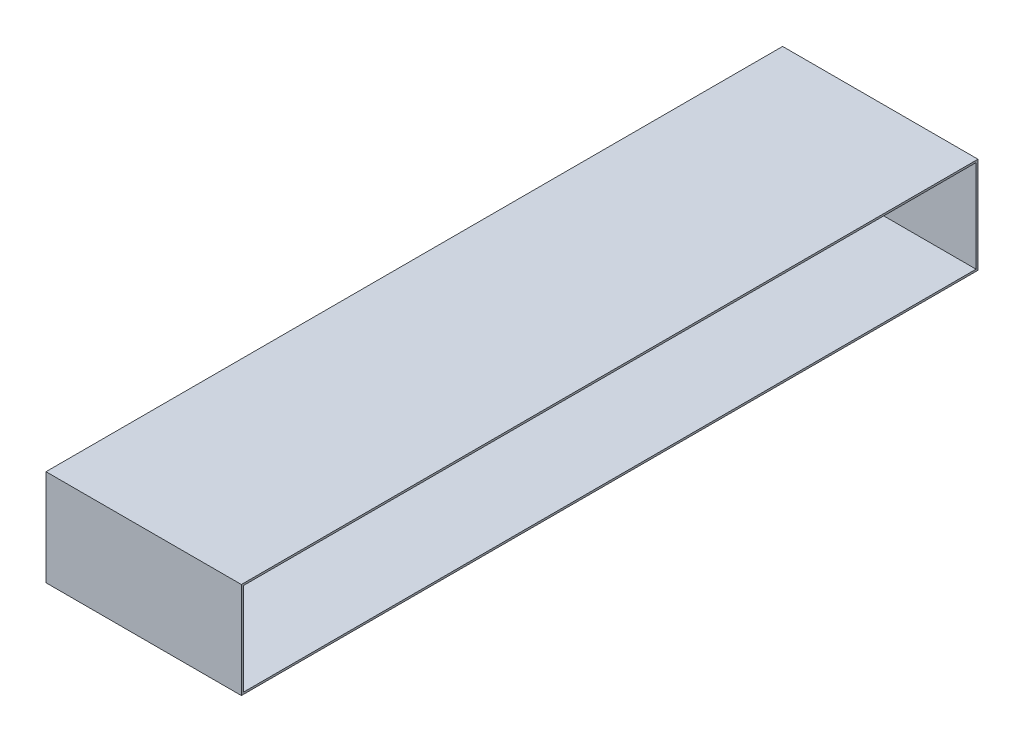
ISO-10303-21;
HEADER;
FILE_DESCRIPTION(('STEP AP214'),'2;1');
FILE_NAME('part.step','',(''),(''),'','','');
FILE_SCHEMA(('AUTOMOTIVE_DESIGN { 1 0 10303 214 1 1 1 1 }'));
ENDSEC;
DATA;
#1=APPLICATION_CONTEXT('core data for automotive mechanical design processes');
#2=APPLICATION_PROTOCOL_DEFINITION('international standard','automotive_design',2000,#1);
#3=PRODUCT_CONTEXT('',#1,'mechanical');
#4=PRODUCT('Part','Part','',(#3));
#5=PRODUCT_RELATED_PRODUCT_CATEGORY('part','',(#4));
#6=PRODUCT_DEFINITION_FORMATION('','',#4);
#7=PRODUCT_DEFINITION_CONTEXT('part definition',#1,'design');
#8=PRODUCT_DEFINITION('design','',#6,#7);
#9=PRODUCT_DEFINITION_SHAPE('','',#8);
#10=(LENGTH_UNIT() NAMED_UNIT(*) SI_UNIT(.MILLI.,.METRE.));
#11=(NAMED_UNIT(*) PLANE_ANGLE_UNIT() SI_UNIT($,.RADIAN.));
#12=(NAMED_UNIT(*) SI_UNIT($,.STERADIAN.) SOLID_ANGLE_UNIT());
#13=UNCERTAINTY_MEASURE_WITH_UNIT(LENGTH_MEASURE(1.E-05),#10,'distance_accuracy_value','');
#14=(GEOMETRIC_REPRESENTATION_CONTEXT(3) GLOBAL_UNCERTAINTY_ASSIGNED_CONTEXT((#13)) GLOBAL_UNIT_ASSIGNED_CONTEXT((#10,
#11,#12)) REPRESENTATION_CONTEXT('',''));
#15=CARTESIAN_POINT('',(0.,0.,0.));
#16=DIRECTION('',(0.,0.,1.));
#17=DIRECTION('',(1.,0.,0.));
#18=AXIS2_PLACEMENT_3D('',#15,#16,#17);
#19=CARTESIAN_POINT('',(12.7,6.254,47.879));
#20=DIRECTION('',(0.,-1.,0.));
#21=DIRECTION('',(0.,0.,-1.));
#22=AXIS2_PLACEMENT_3D('',#19,#20,#21);
#23=PLANE('',#22);
#24=DIRECTION('',(-1.,0.,0.));
#25=VECTOR('',#24,1.);
#26=CARTESIAN_POINT('',(12.7,6.254,47.879));
#27=LINE('',#26,#25);
#28=CARTESIAN_POINT('',(-12.7,6.254,47.879));
#29=VERTEX_POINT('',#28);
#30=CARTESIAN_POINT('',(12.7,6.254,47.879));
#31=VERTEX_POINT('',#30);
#32=EDGE_CURVE('E112',#29,#31,#27,.F.);
#33=ORIENTED_EDGE('',*,*,#32,.T.);
#34=DIRECTION('',(0.,0.,1.));
#35=VECTOR('',#34,1.);
#36=CARTESIAN_POINT('',(12.7,6.254,0.));
#37=LINE('',#36,#35);
#38=CARTESIAN_POINT('',(12.7,6.254,-47.879));
#39=VERTEX_POINT('',#38);
#40=EDGE_CURVE('E107',#31,#39,#37,.F.);
#41=ORIENTED_EDGE('',*,*,#40,.T.);
#42=DIRECTION('',(1.,0.,0.));
#43=VECTOR('',#42,1.);
#44=CARTESIAN_POINT('',(12.7,6.254,-47.879));
#45=LINE('',#44,#43);
#46=CARTESIAN_POINT('',(-12.7,6.254,-47.879));
#47=VERTEX_POINT('',#46);
#48=EDGE_CURVE('E129',#39,#47,#45,.F.);
#49=ORIENTED_EDGE('',*,*,#48,.T.);
#50=DIRECTION('',(0.,0.,1.));
#51=VECTOR('',#50,1.);
#52=CARTESIAN_POINT('',(-12.7,6.254,0.));
#53=LINE('',#52,#51);
#54=EDGE_CURVE('E135',#29,#47,#53,.F.);
#55=ORIENTED_EDGE('',*,*,#54,.F.);
#56=EDGE_LOOP('',(#33,#41,#49,#55));
#57=FACE_BOUND('',#56,.T.);
#58=ADVANCED_FACE('F17',(#57),#23,.F.);
#59=CARTESIAN_POINT('',(12.7,-6.,47.625));
#60=DIRECTION('',(0.,1.,0.));
#61=DIRECTION('',(0.,0.,1.));
#62=AXIS2_PLACEMENT_3D('',#59,#60,#61);
#63=PLANE('',#62);
#64=DIRECTION('',(0.,0.,1.));
#65=VECTOR('',#64,1.);
#66=CARTESIAN_POINT('',(12.7,-6.,0.));
#67=LINE('',#66,#65);
#68=CARTESIAN_POINT('',(12.7,-6.,47.625));
#69=VERTEX_POINT('',#68);
#70=CARTESIAN_POINT('',(12.7,-6.,-47.625));
#71=VERTEX_POINT('',#70);
#72=EDGE_CURVE('E100',#69,#71,#67,.F.);
#73=ORIENTED_EDGE('',*,*,#72,.T.);
#74=DIRECTION('',(1.,0.,0.));
#75=VECTOR('',#74,1.);
#76=CARTESIAN_POINT('',(12.7,-6.,-47.625));
#77=LINE('',#76,#75);
#78=CARTESIAN_POINT('',(-12.7,-6.,-47.625));
#79=VERTEX_POINT('',#78);
#80=EDGE_CURVE('E20',#79,#71,#77,.T.);
#81=ORIENTED_EDGE('',*,*,#80,.F.);
#82=DIRECTION('',(0.,0.,1.));
#83=VECTOR('',#82,1.);
#84=CARTESIAN_POINT('',(-12.7,-6.,0.));
#85=LINE('',#84,#83);
#86=CARTESIAN_POINT('',(-12.7,-6.,47.625));
#87=VERTEX_POINT('',#86);
#88=EDGE_CURVE('E138',#87,#79,#85,.F.);
#89=ORIENTED_EDGE('',*,*,#88,.F.);
#90=DIRECTION('',(-1.,0.,0.));
#91=VECTOR('',#90,1.);
#92=CARTESIAN_POINT('',(12.7,-6.,47.625));
#93=LINE('',#92,#91);
#94=EDGE_CURVE('E88',#69,#87,#93,.T.);
#95=ORIENTED_EDGE('',*,*,#94,.F.);
#96=EDGE_LOOP('',(#73,#81,#89,#95));
#97=FACE_BOUND('',#96,.T.);
#98=ADVANCED_FACE('F125',(#97),#63,.T.);
#99=CARTESIAN_POINT('',(12.7,-6.,-47.625));
#100=DIRECTION('',(0.,0.,1.));
#101=DIRECTION('',(1.,0.,0.));
#102=AXIS2_PLACEMENT_3D('',#99,#100,#101);
#103=PLANE('',#102);
#104=DIRECTION('',(0.,1.,0.));
#105=VECTOR('',#104,1.);
#106=CARTESIAN_POINT('',(12.7,0.,-47.625));
#107=LINE('',#106,#105);
#108=CARTESIAN_POINT('',(12.7,6.,-47.625));
#109=VERTEX_POINT('',#108);
#110=EDGE_CURVE('E119',#71,#109,#107,.T.);
#111=ORIENTED_EDGE('',*,*,#110,.T.);
#112=DIRECTION('',(1.,0.,0.));
#113=VECTOR('',#112,1.);
#114=CARTESIAN_POINT('',(12.7,6.,-47.625));
#115=LINE('',#114,#113);
#116=CARTESIAN_POINT('',(-12.7,6.,-47.625));
#117=VERTEX_POINT('',#116);
#118=EDGE_CURVE('E89',#117,#109,#115,.T.);
#119=ORIENTED_EDGE('',*,*,#118,.F.);
#120=DIRECTION('',(0.,1.,0.));
#121=VECTOR('',#120,1.);
#122=CARTESIAN_POINT('',(-12.7,0.,-47.625));
#123=LINE('',#122,#121);
#124=EDGE_CURVE('E120',#79,#117,#123,.T.);
#125=ORIENTED_EDGE('',*,*,#124,.F.);
#126=ORIENTED_EDGE('',*,*,#80,.T.);
#127=EDGE_LOOP('',(#111,#119,#125,#126));
#128=FACE_BOUND('',#127,.T.);
#129=ADVANCED_FACE('F118',(#128),#103,.T.);
#130=CARTESIAN_POINT('',(12.7,6.,47.625));
#131=DIRECTION('',(0.,-1.,0.));
#132=DIRECTION('',(0.,0.,-1.));
#133=AXIS2_PLACEMENT_3D('',#130,#131,#132);
#134=PLANE('',#133);
#135=DIRECTION('',(0.,0.,1.));
#136=VECTOR('',#135,1.);
#137=CARTESIAN_POINT('',(12.7,6.,0.));
#138=LINE('',#137,#136);
#139=CARTESIAN_POINT('',(12.7,6.,47.625));
#140=VERTEX_POINT('',#139);
#141=EDGE_CURVE('E97',#109,#140,#138,.T.);
#142=ORIENTED_EDGE('',*,*,#141,.T.);
#143=DIRECTION('',(-1.,0.,0.));
#144=VECTOR('',#143,1.);
#145=CARTESIAN_POINT('',(12.7,6.,47.625));
#146=LINE('',#145,#144);
#147=CARTESIAN_POINT('',(-12.7,6.,47.625));
#148=VERTEX_POINT('',#147);
#149=EDGE_CURVE('E79',#148,#140,#146,.F.);
#150=ORIENTED_EDGE('',*,*,#149,.F.);
#151=DIRECTION('',(0.,0.,1.));
#152=VECTOR('',#151,1.);
#153=CARTESIAN_POINT('',(-12.7,6.,0.));
#154=LINE('',#153,#152);
#155=EDGE_CURVE('E141',#117,#148,#154,.T.);
#156=ORIENTED_EDGE('',*,*,#155,.F.);
#157=ORIENTED_EDGE('',*,*,#118,.T.);
#158=EDGE_LOOP('',(#142,#150,#156,#157));
#159=FACE_BOUND('',#158,.T.);
#160=ADVANCED_FACE('F102',(#159),#134,.T.);
#161=CARTESIAN_POINT('',(12.7,-6.,47.625));
#162=DIRECTION('',(0.,0.,-1.));
#163=DIRECTION('',(-1.,0.,0.));
#164=AXIS2_PLACEMENT_3D('',#161,#162,#163);
#165=PLANE('',#164);
#166=DIRECTION('',(0.,1.,0.));
#167=VECTOR('',#166,1.);
#168=CARTESIAN_POINT('',(12.7,0.,47.625));
#169=LINE('',#168,#167);
#170=EDGE_CURVE('E82',#140,#69,#169,.F.);
#171=ORIENTED_EDGE('',*,*,#170,.T.);
#172=ORIENTED_EDGE('',*,*,#94,.T.);
#173=DIRECTION('',(0.,1.,0.));
#174=VECTOR('',#173,1.);
#175=CARTESIAN_POINT('',(-12.7,0.,47.625));
#176=LINE('',#175,#174);
#177=EDGE_CURVE('E84',#148,#87,#176,.F.);
#178=ORIENTED_EDGE('',*,*,#177,.F.);
#179=ORIENTED_EDGE('',*,*,#149,.T.);
#180=EDGE_LOOP('',(#171,#172,#178,#179));
#181=FACE_BOUND('',#180,.T.);
#182=ADVANCED_FACE('F81',(#181),#165,.T.);
#183=CARTESIAN_POINT('',(12.7,-6.254,47.879));
#184=DIRECTION('',(0.,0.,-1.));
#185=DIRECTION('',(-1.,0.,0.));
#186=AXIS2_PLACEMENT_3D('',#183,#184,#185);
#187=PLANE('',#186);
#188=DIRECTION('',(1.,0.,0.));
#189=VECTOR('',#188,1.);
#190=CARTESIAN_POINT('',(12.7,-6.254,47.879));
#191=LINE('',#190,#189);
#192=CARTESIAN_POINT('',(-12.7,-6.254,47.879));
#193=VERTEX_POINT('',#192);
#194=CARTESIAN_POINT('',(12.7,-6.254,47.879));
#195=VERTEX_POINT('',#194);
#196=EDGE_CURVE('E144',#193,#195,#191,.T.);
#197=ORIENTED_EDGE('',*,*,#196,.T.);
#198=DIRECTION('',(0.,1.,0.));
#199=VECTOR('',#198,1.);
#200=CARTESIAN_POINT('',(12.7,0.,47.879));
#201=LINE('',#200,#199);
#202=EDGE_CURVE('E104',#195,#31,#201,.T.);
#203=ORIENTED_EDGE('',*,*,#202,.T.);
#204=ORIENTED_EDGE('',*,*,#32,.F.);
#205=DIRECTION('',(0.,1.,0.));
#206=VECTOR('',#205,1.);
#207=CARTESIAN_POINT('',(-12.7,0.,47.879));
#208=LINE('',#207,#206);
#209=EDGE_CURVE('E132',#193,#29,#208,.T.);
#210=ORIENTED_EDGE('',*,*,#209,.F.);
#211=EDGE_LOOP('',(#197,#203,#204,#210));
#212=FACE_BOUND('',#211,.T.);
#213=ADVANCED_FACE('F160',(#212),#187,.F.);
#214=CARTESIAN_POINT('',(12.7,0.,0.));
#215=DIRECTION('',(-1.,0.,0.));
#216=DIRECTION('',(0.,0.,1.));
#217=AXIS2_PLACEMENT_3D('',#214,#215,#216);
#218=PLANE('',#217);
#219=ORIENTED_EDGE('',*,*,#72,.F.);
#220=ORIENTED_EDGE('',*,*,#170,.F.);
#221=ORIENTED_EDGE('',*,*,#141,.F.);
#222=ORIENTED_EDGE('',*,*,#110,.F.);
#223=EDGE_LOOP('',(#219,#220,#221,#222));
#224=FACE_BOUND('',#223,.T.);
#225=DIRECTION('',(0.,0.,1.));
#226=VECTOR('',#225,1.);
#227=CARTESIAN_POINT('',(12.7,-6.254,47.879));
#228=LINE('',#227,#226);
#229=CARTESIAN_POINT('',(12.7,-6.254,-47.879));
#230=VERTEX_POINT('',#229);
#231=EDGE_CURVE('E147',#195,#230,#228,.F.);
#232=ORIENTED_EDGE('',*,*,#231,.T.);
#233=DIRECTION('',(0.,-1.,0.));
#234=VECTOR('',#233,1.);
#235=CARTESIAN_POINT('',(12.7,-6.254,-47.879));
#236=LINE('',#235,#234);
#237=EDGE_CURVE('E123',#230,#39,#236,.F.);
#238=ORIENTED_EDGE('',*,*,#237,.T.);
#239=ORIENTED_EDGE('',*,*,#40,.F.);
#240=ORIENTED_EDGE('',*,*,#202,.F.);
#241=EDGE_LOOP('',(#232,#238,#239,#240));
#242=FACE_BOUND('',#241,.T.);
#243=ADVANCED_FACE('F94',(#224,#242),#218,.F.);
#244=CARTESIAN_POINT('',(12.7,-6.254,-47.879));
#245=DIRECTION('',(0.,0.,1.));
#246=DIRECTION('',(0.,-1.,0.));
#247=AXIS2_PLACEMENT_3D('',#244,#245,#246);
#248=PLANE('',#247);
#249=ORIENTED_EDGE('',*,*,#48,.F.);
#250=ORIENTED_EDGE('',*,*,#237,.F.);
#251=DIRECTION('',(1.,0.,0.));
#252=VECTOR('',#251,1.);
#253=CARTESIAN_POINT('',(12.7,-6.254,-47.879));
#254=LINE('',#253,#252);
#255=CARTESIAN_POINT('',(-12.7,-6.254,-47.879));
#256=VERTEX_POINT('',#255);
#257=EDGE_CURVE('E26',#230,#256,#254,.F.);
#258=ORIENTED_EDGE('',*,*,#257,.T.);
#259=DIRECTION('',(0.,1.,0.));
#260=VECTOR('',#259,1.);
#261=CARTESIAN_POINT('',(-12.7,0.,-47.879));
#262=LINE('',#261,#260);
#263=EDGE_CURVE('E34',#47,#256,#262,.F.);
#264=ORIENTED_EDGE('',*,*,#263,.F.);
#265=EDGE_LOOP('',(#249,#250,#258,#264));
#266=FACE_BOUND('',#265,.T.);
#267=ADVANCED_FACE('F154',(#266),#248,.F.);
#268=CARTESIAN_POINT('',(-12.7,0.,0.));
#269=DIRECTION('',(-1.,0.,0.));
#270=DIRECTION('',(0.,0.,1.));
#271=AXIS2_PLACEMENT_3D('',#268,#269,#270);
#272=PLANE('',#271);
#273=ORIENTED_EDGE('',*,*,#155,.T.);
#274=ORIENTED_EDGE('',*,*,#177,.T.);
#275=ORIENTED_EDGE('',*,*,#88,.T.);
#276=ORIENTED_EDGE('',*,*,#124,.T.);
#277=EDGE_LOOP('',(#273,#274,#275,#276));
#278=FACE_BOUND('',#277,.T.);
#279=ORIENTED_EDGE('',*,*,#263,.T.);
#280=DIRECTION('',(0.,0.,1.));
#281=VECTOR('',#280,1.);
#282=CARTESIAN_POINT('',(-12.7,-6.254,47.879));
#283=LINE('',#282,#281);
#284=EDGE_CURVE('E11',#256,#193,#283,.T.);
#285=ORIENTED_EDGE('',*,*,#284,.T.);
#286=ORIENTED_EDGE('',*,*,#209,.T.);
#287=ORIENTED_EDGE('',*,*,#54,.T.);
#288=EDGE_LOOP('',(#279,#285,#286,#287));
#289=FACE_BOUND('',#288,.T.);
#290=ADVANCED_FACE('F163',(#278,#289),#272,.T.);
#291=CARTESIAN_POINT('',(12.7,-6.254,47.879));
#292=DIRECTION('',(0.,1.,0.));
#293=DIRECTION('',(0.,0.,1.));
#294=AXIS2_PLACEMENT_3D('',#291,#292,#293);
#295=PLANE('',#294);
#296=ORIENTED_EDGE('',*,*,#257,.F.);
#297=ORIENTED_EDGE('',*,*,#231,.F.);
#298=ORIENTED_EDGE('',*,*,#196,.F.);
#299=ORIENTED_EDGE('',*,*,#284,.F.);
#300=EDGE_LOOP('',(#296,#297,#298,#299));
#301=FACE_BOUND('',#300,.T.);
#302=ADVANCED_FACE('F157',(#301),#295,.F.);
#303=CLOSED_SHELL('',(#58,#98,#129,#160,#182,#213,#243,#267,#290,#302));
#304=MANIFOLD_SOLID_BREP('B1',#303);
#305=ADVANCED_BREP_SHAPE_REPRESENTATION('',(#18,#304),#14);
#306=SHAPE_DEFINITION_REPRESENTATION(#9,#305);
ENDSEC;
END-ISO-10303-21;
